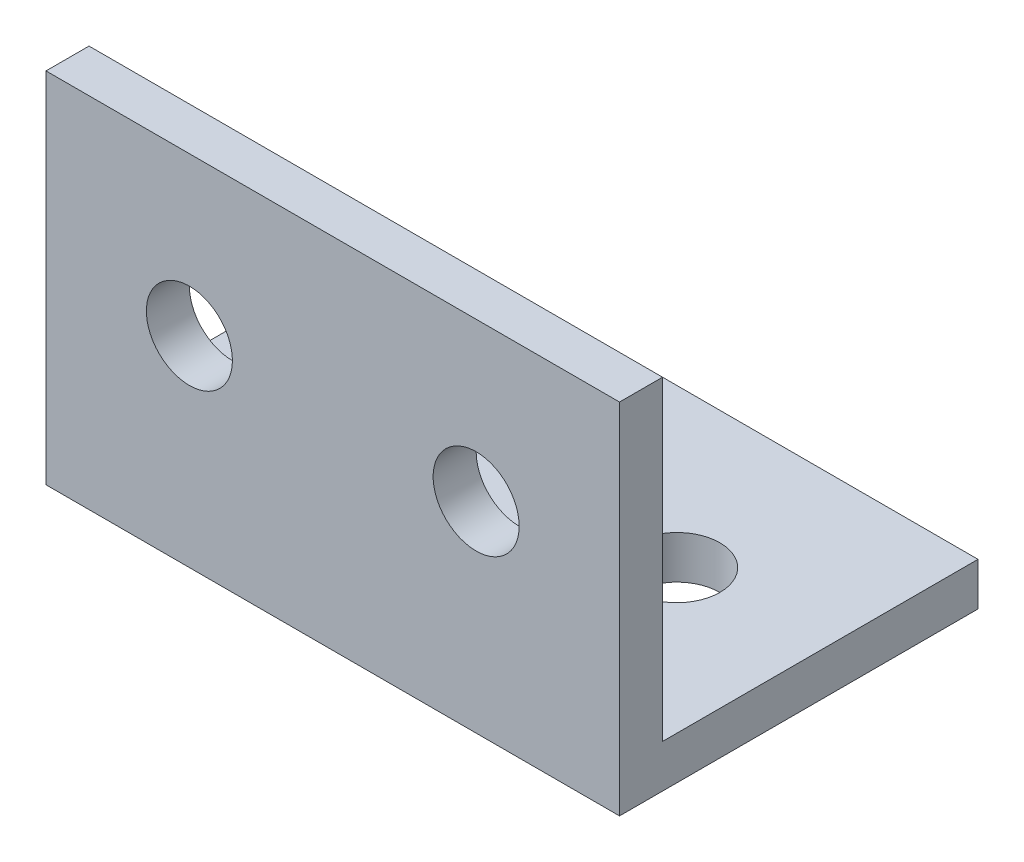
ISO-10303-21;
HEADER;
FILE_DESCRIPTION(('STEP AP214'),'2;1');
FILE_NAME('part.step','',(''),(''),'','','');
FILE_SCHEMA(('AUTOMOTIVE_DESIGN { 1 0 10303 214 1 1 1 1 }'));
ENDSEC;
DATA;
#1=APPLICATION_CONTEXT('core data for automotive mechanical design processes');
#2=APPLICATION_PROTOCOL_DEFINITION('international standard','automotive_design',2000,#1);
#3=PRODUCT_CONTEXT('',#1,'mechanical');
#4=PRODUCT('Part','Part','',(#3));
#5=PRODUCT_RELATED_PRODUCT_CATEGORY('part','',(#4));
#6=PRODUCT_DEFINITION_FORMATION('','',#4);
#7=PRODUCT_DEFINITION_CONTEXT('part definition',#1,'design');
#8=PRODUCT_DEFINITION('design','',#6,#7);
#9=PRODUCT_DEFINITION_SHAPE('','',#8);
#10=(LENGTH_UNIT() NAMED_UNIT(*) SI_UNIT(.MILLI.,.METRE.));
#11=(NAMED_UNIT(*) PLANE_ANGLE_UNIT() SI_UNIT($,.RADIAN.));
#12=(NAMED_UNIT(*) SI_UNIT($,.STERADIAN.) SOLID_ANGLE_UNIT());
#13=UNCERTAINTY_MEASURE_WITH_UNIT(LENGTH_MEASURE(1.E-05),#10,'distance_accuracy_value','');
#14=(GEOMETRIC_REPRESENTATION_CONTEXT(3) GLOBAL_UNCERTAINTY_ASSIGNED_CONTEXT((#13)) GLOBAL_UNIT_ASSIGNED_CONTEXT((#10,
#11,#12)) REPRESENTATION_CONTEXT('',''));
#15=CARTESIAN_POINT('',(0.,0.,0.));
#16=DIRECTION('',(0.,0.,1.));
#17=DIRECTION('',(1.,0.,0.));
#18=AXIS2_PLACEMENT_3D('',#15,#16,#17);
#19=CARTESIAN_POINT('',(40.,0.,0.));
#20=DIRECTION('',(0.,1.,0.));
#21=DIRECTION('',(0.,0.,1.));
#22=AXIS2_PLACEMENT_3D('',#19,#20,#21);
#23=PLANE('',#22);
#24=CARTESIAN_POINT('',(10.,0.,-14.));
#25=DIRECTION('',(0.,-1.,0.));
#26=DIRECTION('',(0.,0.,-1.));
#27=AXIS2_PLACEMENT_3D('',#24,#25,#26);
#28=CIRCLE('',#27,3.);
#29=CARTESIAN_POINT('',(10.,0.,-17.));
#30=VERTEX_POINT('',#29);
#31=EDGE_CURVE('E133',#30,#30,#28,.T.);
#32=ORIENTED_EDGE('',*,*,#31,.F.);
#33=EDGE_LOOP('',(#32));
#34=FACE_BOUND('',#33,.T.);
#35=CARTESIAN_POINT('',(30.,0.,-14.));
#36=DIRECTION('',(0.,-1.,0.));
#37=DIRECTION('',(0.,0.,-1.));
#38=AXIS2_PLACEMENT_3D('',#35,#36,#37);
#39=CIRCLE('',#38,3.);
#40=CARTESIAN_POINT('',(30.,0.,-17.));
#41=VERTEX_POINT('',#40);
#42=EDGE_CURVE('E138',#41,#41,#39,.T.);
#43=ORIENTED_EDGE('',*,*,#42,.F.);
#44=EDGE_LOOP('',(#43));
#45=FACE_BOUND('',#44,.T.);
#46=DIRECTION('',(0.,0.,-1.));
#47=VECTOR('',#46,1.);
#48=CARTESIAN_POINT('',(0.,0.,0.));
#49=LINE('',#48,#47);
#50=CARTESIAN_POINT('',(0.,0.,0.));
#51=VERTEX_POINT('',#50);
#52=CARTESIAN_POINT('',(0.,0.,-25.));
#53=VERTEX_POINT('',#52);
#54=EDGE_CURVE('E115',#51,#53,#49,.T.);
#55=ORIENTED_EDGE('',*,*,#54,.T.);
#56=DIRECTION('',(-1.,0.,0.));
#57=VECTOR('',#56,1.);
#58=CARTESIAN_POINT('',(40.,0.,-25.));
#59=LINE('',#58,#57);
#60=CARTESIAN_POINT('',(40.,0.,-25.));
#61=VERTEX_POINT('',#60);
#62=EDGE_CURVE('E11',#61,#53,#59,.T.);
#63=ORIENTED_EDGE('',*,*,#62,.F.);
#64=DIRECTION('',(0.,0.,-1.));
#65=VECTOR('',#64,1.);
#66=CARTESIAN_POINT('',(40.,0.,0.));
#67=LINE('',#66,#65);
#68=CARTESIAN_POINT('',(40.,0.,0.));
#69=VERTEX_POINT('',#68);
#70=EDGE_CURVE('E80',#69,#61,#67,.T.);
#71=ORIENTED_EDGE('',*,*,#70,.F.);
#72=DIRECTION('',(-1.,0.,0.));
#73=VECTOR('',#72,1.);
#74=CARTESIAN_POINT('',(40.,0.,0.));
#75=LINE('',#74,#73);
#76=EDGE_CURVE('E111',#69,#51,#75,.T.);
#77=ORIENTED_EDGE('',*,*,#76,.T.);
#78=EDGE_LOOP('',(#55,#63,#71,#77));
#79=FACE_BOUND('',#78,.T.);
#80=ADVANCED_FACE('F32',(#34,#45,#79),#23,.F.);
#81=CARTESIAN_POINT('',(40.,3.,-25.));
#82=DIRECTION('',(0.,0.,-1.));
#83=DIRECTION('',(-1.,0.,0.));
#84=AXIS2_PLACEMENT_3D('',#81,#82,#83);
#85=PLANE('',#84);
#86=DIRECTION('',(0.,-1.,0.));
#87=VECTOR('',#86,1.);
#88=CARTESIAN_POINT('',(0.,3.,-25.));
#89=LINE('',#88,#87);
#90=CARTESIAN_POINT('',(0.,3.,-25.));
#91=VERTEX_POINT('',#90);
#92=EDGE_CURVE('E118',#91,#53,#89,.T.);
#93=ORIENTED_EDGE('',*,*,#92,.F.);
#94=DIRECTION('',(-1.,0.,0.));
#95=VECTOR('',#94,1.);
#96=CARTESIAN_POINT('',(40.,3.,-25.));
#97=LINE('',#96,#95);
#98=CARTESIAN_POINT('',(40.,3.,-25.));
#99=VERTEX_POINT('',#98);
#100=EDGE_CURVE('E41',#99,#91,#97,.T.);
#101=ORIENTED_EDGE('',*,*,#100,.F.);
#102=DIRECTION('',(0.,-1.,0.));
#103=VECTOR('',#102,1.);
#104=CARTESIAN_POINT('',(40.,3.,-25.));
#105=LINE('',#104,#103);
#106=EDGE_CURVE('E149',#99,#61,#105,.T.);
#107=ORIENTED_EDGE('',*,*,#106,.T.);
#108=ORIENTED_EDGE('',*,*,#62,.T.);
#109=EDGE_LOOP('',(#93,#101,#107,#108));
#110=FACE_BOUND('',#109,.T.);
#111=ADVANCED_FACE('F173',(#110),#85,.T.);
#112=CARTESIAN_POINT('',(40.,3.,0.));
#113=DIRECTION('',(0.,1.,0.));
#114=DIRECTION('',(0.,0.,1.));
#115=AXIS2_PLACEMENT_3D('',#112,#113,#114);
#116=PLANE('',#115);
#117=CARTESIAN_POINT('',(10.,3.,-14.));
#118=DIRECTION('',(0.,1.,0.));
#119=DIRECTION('',(0.,0.,1.));
#120=AXIS2_PLACEMENT_3D('',#117,#118,#119);
#121=CIRCLE('',#120,3.);
#122=CARTESIAN_POINT('',(10.,3.,-11.));
#123=VERTEX_POINT('',#122);
#124=EDGE_CURVE('E35',#123,#123,#121,.T.);
#125=ORIENTED_EDGE('',*,*,#124,.F.);
#126=EDGE_LOOP('',(#125));
#127=FACE_BOUND('',#126,.T.);
#128=CARTESIAN_POINT('',(30.,3.,-14.));
#129=DIRECTION('',(0.,1.,0.));
#130=DIRECTION('',(0.,0.,1.));
#131=AXIS2_PLACEMENT_3D('',#128,#129,#130);
#132=CIRCLE('',#131,3.);
#133=CARTESIAN_POINT('',(30.,3.,-11.));
#134=VERTEX_POINT('',#133);
#135=EDGE_CURVE('E131',#134,#134,#132,.T.);
#136=ORIENTED_EDGE('',*,*,#135,.F.);
#137=EDGE_LOOP('',(#136));
#138=FACE_BOUND('',#137,.T.);
#139=DIRECTION('',(0.,0.,-1.));
#140=VECTOR('',#139,1.);
#141=CARTESIAN_POINT('',(0.,3.,0.));
#142=LINE('',#141,#140);
#143=CARTESIAN_POINT('',(0.,3.,-3.));
#144=VERTEX_POINT('',#143);
#145=EDGE_CURVE('E121',#144,#91,#142,.T.);
#146=ORIENTED_EDGE('',*,*,#145,.F.);
#147=DIRECTION('',(-1.,0.,0.));
#148=VECTOR('',#147,1.);
#149=CARTESIAN_POINT('',(40.,3.,-3.));
#150=LINE('',#149,#148);
#151=CARTESIAN_POINT('',(40.,3.,-3.));
#152=VERTEX_POINT('',#151);
#153=EDGE_CURVE('E101',#152,#144,#150,.T.);
#154=ORIENTED_EDGE('',*,*,#153,.F.);
#155=DIRECTION('',(0.,0.,-1.));
#156=VECTOR('',#155,1.);
#157=CARTESIAN_POINT('',(40.,3.,0.));
#158=LINE('',#157,#156);
#159=EDGE_CURVE('E107',#152,#99,#158,.T.);
#160=ORIENTED_EDGE('',*,*,#159,.T.);
#161=ORIENTED_EDGE('',*,*,#100,.T.);
#162=EDGE_LOOP('',(#146,#154,#160,#161));
#163=FACE_BOUND('',#162,.T.);
#164=ADVANCED_FACE('F153',(#127,#138,#163),#116,.T.);
#165=CARTESIAN_POINT('',(40.,0.,-3.));
#166=DIRECTION('',(0.,0.,-1.));
#167=DIRECTION('',(-1.,0.,0.));
#168=AXIS2_PLACEMENT_3D('',#165,#166,#167);
#169=PLANE('',#168);
#170=CARTESIAN_POINT('',(10.,14.,-3.));
#171=DIRECTION('',(0.,0.,-1.));
#172=DIRECTION('',(-1.,0.,0.));
#173=AXIS2_PLACEMENT_3D('',#170,#171,#172);
#174=CIRCLE('',#173,3.);
#175=CARTESIAN_POINT('',(7.,14.,-3.));
#176=VERTEX_POINT('',#175);
#177=EDGE_CURVE('E143',#176,#176,#174,.T.);
#178=ORIENTED_EDGE('',*,*,#177,.F.);
#179=EDGE_LOOP('',(#178));
#180=FACE_BOUND('',#179,.T.);
#181=CARTESIAN_POINT('',(30.,14.,-3.));
#182=DIRECTION('',(0.,0.,-1.));
#183=DIRECTION('',(-1.,0.,0.));
#184=AXIS2_PLACEMENT_3D('',#181,#182,#183);
#185=CIRCLE('',#184,3.);
#186=CARTESIAN_POINT('',(27.,14.,-3.));
#187=VERTEX_POINT('',#186);
#188=EDGE_CURVE('E207',#187,#187,#185,.T.);
#189=ORIENTED_EDGE('',*,*,#188,.F.);
#190=EDGE_LOOP('',(#189));
#191=FACE_BOUND('',#190,.T.);
#192=DIRECTION('',(0.,1.,0.));
#193=VECTOR('',#192,1.);
#194=CARTESIAN_POINT('',(0.,0.,-3.));
#195=LINE('',#194,#193);
#196=CARTESIAN_POINT('',(0.,25.,-3.));
#197=VERTEX_POINT('',#196);
#198=EDGE_CURVE('E96',#197,#144,#195,.F.);
#199=ORIENTED_EDGE('',*,*,#198,.F.);
#200=DIRECTION('',(-1.,0.,0.));
#201=VECTOR('',#200,1.);
#202=CARTESIAN_POINT('',(40.,25.,-3.));
#203=LINE('',#202,#201);
#204=CARTESIAN_POINT('',(40.,25.,-3.));
#205=VERTEX_POINT('',#204);
#206=EDGE_CURVE('E91',#205,#197,#203,.T.);
#207=ORIENTED_EDGE('',*,*,#206,.F.);
#208=DIRECTION('',(0.,1.,0.));
#209=VECTOR('',#208,1.);
#210=CARTESIAN_POINT('',(40.,0.,-3.));
#211=LINE('',#210,#209);
#212=EDGE_CURVE('E94',#205,#152,#211,.F.);
#213=ORIENTED_EDGE('',*,*,#212,.T.);
#214=ORIENTED_EDGE('',*,*,#153,.T.);
#215=EDGE_LOOP('',(#199,#207,#213,#214));
#216=FACE_BOUND('',#215,.T.);
#217=ADVANCED_FACE('F93',(#180,#191,#216),#169,.T.);
#218=CARTESIAN_POINT('',(40.,25.,0.));
#219=DIRECTION('',(0.,1.,0.));
#220=DIRECTION('',(0.,0.,1.));
#221=AXIS2_PLACEMENT_3D('',#218,#219,#220);
#222=PLANE('',#221);
#223=DIRECTION('',(0.,0.,-1.));
#224=VECTOR('',#223,1.);
#225=CARTESIAN_POINT('',(0.,25.,0.));
#226=LINE('',#225,#224);
#227=CARTESIAN_POINT('',(0.,25.,0.));
#228=VERTEX_POINT('',#227);
#229=EDGE_CURVE('E125',#228,#197,#226,.T.);
#230=ORIENTED_EDGE('',*,*,#229,.F.);
#231=DIRECTION('',(-1.,0.,0.));
#232=VECTOR('',#231,1.);
#233=CARTESIAN_POINT('',(40.,25.,0.));
#234=LINE('',#233,#232);
#235=CARTESIAN_POINT('',(40.,25.,0.));
#236=VERTEX_POINT('',#235);
#237=EDGE_CURVE('E71',#236,#228,#234,.T.);
#238=ORIENTED_EDGE('',*,*,#237,.F.);
#239=DIRECTION('',(0.,0.,-1.));
#240=VECTOR('',#239,1.);
#241=CARTESIAN_POINT('',(40.,25.,0.));
#242=LINE('',#241,#240);
#243=EDGE_CURVE('E105',#236,#205,#242,.T.);
#244=ORIENTED_EDGE('',*,*,#243,.T.);
#245=ORIENTED_EDGE('',*,*,#206,.T.);
#246=EDGE_LOOP('',(#230,#238,#244,#245));
#247=FACE_BOUND('',#246,.T.);
#248=ADVANCED_FACE('F109',(#247),#222,.T.);
#249=CARTESIAN_POINT('',(40.,0.,0.));
#250=DIRECTION('',(0.,0.,-1.));
#251=DIRECTION('',(-1.,0.,0.));
#252=AXIS2_PLACEMENT_3D('',#249,#250,#251);
#253=PLANE('',#252);
#254=CARTESIAN_POINT('',(10.,14.,0.));
#255=DIRECTION('',(0.,0.,1.));
#256=DIRECTION('',(1.,0.,0.));
#257=AXIS2_PLACEMENT_3D('',#254,#255,#256);
#258=CIRCLE('',#257,3.);
#259=CARTESIAN_POINT('',(13.,14.,0.));
#260=VERTEX_POINT('',#259);
#261=EDGE_CURVE('E206',#260,#260,#258,.T.);
#262=ORIENTED_EDGE('',*,*,#261,.F.);
#263=EDGE_LOOP('',(#262));
#264=FACE_BOUND('',#263,.T.);
#265=CARTESIAN_POINT('',(30.,14.,0.));
#266=DIRECTION('',(0.,0.,1.));
#267=DIRECTION('',(1.,0.,0.));
#268=AXIS2_PLACEMENT_3D('',#265,#266,#267);
#269=CIRCLE('',#268,3.);
#270=CARTESIAN_POINT('',(33.,14.,0.));
#271=VERTEX_POINT('',#270);
#272=EDGE_CURVE('E208',#271,#271,#269,.T.);
#273=ORIENTED_EDGE('',*,*,#272,.F.);
#274=EDGE_LOOP('',(#273));
#275=FACE_BOUND('',#274,.T.);
#276=DIRECTION('',(0.,-1.,0.));
#277=VECTOR('',#276,1.);
#278=CARTESIAN_POINT('',(0.,0.,0.));
#279=LINE('',#278,#277);
#280=EDGE_CURVE('E74',#228,#51,#279,.T.);
#281=ORIENTED_EDGE('',*,*,#280,.T.);
#282=ORIENTED_EDGE('',*,*,#76,.F.);
#283=DIRECTION('',(0.,-1.,0.));
#284=VECTOR('',#283,1.);
#285=CARTESIAN_POINT('',(40.,0.,0.));
#286=LINE('',#285,#284);
#287=EDGE_CURVE('E50',#236,#69,#286,.T.);
#288=ORIENTED_EDGE('',*,*,#287,.F.);
#289=ORIENTED_EDGE('',*,*,#237,.T.);
#290=EDGE_LOOP('',(#281,#282,#288,#289));
#291=FACE_BOUND('',#290,.T.);
#292=ADVANCED_FACE('F159',(#264,#275,#291),#253,.F.);
#293=CARTESIAN_POINT('',(40.,0.,0.));
#294=DIRECTION('',(-1.,0.,0.));
#295=DIRECTION('',(0.,0.,1.));
#296=AXIS2_PLACEMENT_3D('',#293,#294,#295);
#297=PLANE('',#296);
#298=ORIENTED_EDGE('',*,*,#70,.T.);
#299=ORIENTED_EDGE('',*,*,#106,.F.);
#300=ORIENTED_EDGE('',*,*,#159,.F.);
#301=ORIENTED_EDGE('',*,*,#212,.F.);
#302=ORIENTED_EDGE('',*,*,#243,.F.);
#303=ORIENTED_EDGE('',*,*,#287,.T.);
#304=EDGE_LOOP('',(#298,#299,#300,#301,#302,#303));
#305=FACE_BOUND('',#304,.T.);
#306=ADVANCED_FACE('F104',(#305),#297,.F.);
#307=CARTESIAN_POINT('',(0.,0.,0.));
#308=DIRECTION('',(-1.,0.,0.));
#309=DIRECTION('',(0.,0.,1.));
#310=AXIS2_PLACEMENT_3D('',#307,#308,#309);
#311=PLANE('',#310);
#312=ORIENTED_EDGE('',*,*,#54,.F.);
#313=ORIENTED_EDGE('',*,*,#280,.F.);
#314=ORIENTED_EDGE('',*,*,#229,.T.);
#315=ORIENTED_EDGE('',*,*,#198,.T.);
#316=ORIENTED_EDGE('',*,*,#145,.T.);
#317=ORIENTED_EDGE('',*,*,#92,.T.);
#318=EDGE_LOOP('',(#312,#313,#314,#315,#316,#317));
#319=FACE_BOUND('',#318,.T.);
#320=ADVANCED_FACE('F157',(#319),#311,.T.);
#321=CARTESIAN_POINT('',(30.,10.,-14.));
#322=DIRECTION('',(0.,-1.,0.));
#323=DIRECTION('',(0.,0.,-1.));
#324=AXIS2_PLACEMENT_3D('',#321,#322,#323);
#325=CYLINDRICAL_SURFACE('',#324,3.);
#326=ORIENTED_EDGE('',*,*,#135,.T.);
#327=EDGE_LOOP('',(#326));
#328=FACE_BOUND('',#327,.T.);
#329=ORIENTED_EDGE('',*,*,#42,.T.);
#330=EDGE_LOOP('',(#329));
#331=FACE_BOUND('',#330,.T.);
#332=ADVANCED_FACE('F182',(#328,#331),#325,.F.);
#333=CARTESIAN_POINT('',(10.,10.,-14.));
#334=DIRECTION('',(0.,-1.,0.));
#335=DIRECTION('',(0.,0.,-1.));
#336=AXIS2_PLACEMENT_3D('',#333,#334,#335);
#337=CYLINDRICAL_SURFACE('',#336,3.);
#338=ORIENTED_EDGE('',*,*,#124,.T.);
#339=EDGE_LOOP('',(#338));
#340=FACE_BOUND('',#339,.T.);
#341=ORIENTED_EDGE('',*,*,#31,.T.);
#342=EDGE_LOOP('',(#341));
#343=FACE_BOUND('',#342,.T.);
#344=ADVANCED_FACE('F184',(#340,#343),#337,.F.);
#345=CARTESIAN_POINT('',(30.,14.,-10.));
#346=DIRECTION('',(0.,0.,1.));
#347=DIRECTION('',(1.,0.,0.));
#348=AXIS2_PLACEMENT_3D('',#345,#346,#347);
#349=CYLINDRICAL_SURFACE('',#348,3.);
#350=ORIENTED_EDGE('',*,*,#188,.T.);
#351=EDGE_LOOP('',(#350));
#352=FACE_BOUND('',#351,.T.);
#353=ORIENTED_EDGE('',*,*,#272,.T.);
#354=EDGE_LOOP('',(#353));
#355=FACE_BOUND('',#354,.T.);
#356=ADVANCED_FACE('F190',(#352,#355),#349,.F.);
#357=CARTESIAN_POINT('',(10.,14.,-10.));
#358=DIRECTION('',(0.,0.,1.));
#359=DIRECTION('',(1.,0.,0.));
#360=AXIS2_PLACEMENT_3D('',#357,#358,#359);
#361=CYLINDRICAL_SURFACE('',#360,3.);
#362=ORIENTED_EDGE('',*,*,#177,.T.);
#363=EDGE_LOOP('',(#362));
#364=FACE_BOUND('',#363,.T.);
#365=ORIENTED_EDGE('',*,*,#261,.T.);
#366=EDGE_LOOP('',(#365));
#367=FACE_BOUND('',#366,.T.);
#368=ADVANCED_FACE('F196',(#364,#367),#361,.F.);
#369=CLOSED_SHELL('',(#80,#111,#164,#217,#248,#292,#306,#320,#332,#344,#356,#368));
#370=MANIFOLD_SOLID_BREP('B2',#369);
#371=ADVANCED_BREP_SHAPE_REPRESENTATION('',(#18,#370),#14);
#372=SHAPE_DEFINITION_REPRESENTATION(#9,#371);
ENDSEC;
END-ISO-10303-21;
